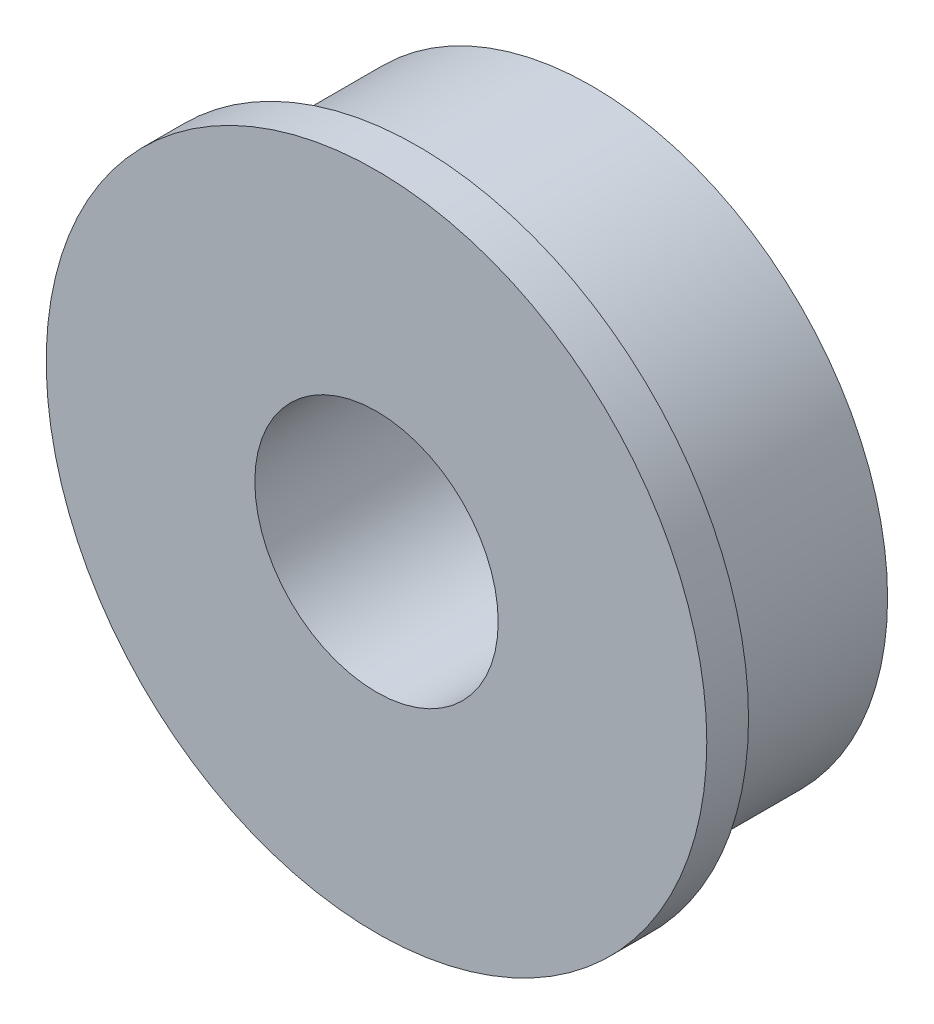
ISO-10303-21;
HEADER;
FILE_DESCRIPTION(('STEP AP214'),'2;1');
FILE_NAME('part.step','',(''),(''),'','','');
FILE_SCHEMA(('AUTOMOTIVE_DESIGN { 1 0 10303 214 1 1 1 1 }'));
ENDSEC;
DATA;
#1=APPLICATION_CONTEXT('core data for automotive mechanical design processes');
#2=APPLICATION_PROTOCOL_DEFINITION('international standard','automotive_design',2000,#1);
#3=PRODUCT_CONTEXT('',#1,'mechanical');
#4=PRODUCT('Part','Part','',(#3));
#5=PRODUCT_RELATED_PRODUCT_CATEGORY('part','',(#4));
#6=PRODUCT_DEFINITION_FORMATION('','',#4);
#7=PRODUCT_DEFINITION_CONTEXT('part definition',#1,'design');
#8=PRODUCT_DEFINITION('design','',#6,#7);
#9=PRODUCT_DEFINITION_SHAPE('','',#8);
#10=(LENGTH_UNIT() NAMED_UNIT(*) SI_UNIT(.MILLI.,.METRE.));
#11=(NAMED_UNIT(*) PLANE_ANGLE_UNIT() SI_UNIT($,.RADIAN.));
#12=(NAMED_UNIT(*) SI_UNIT($,.STERADIAN.) SOLID_ANGLE_UNIT());
#13=UNCERTAINTY_MEASURE_WITH_UNIT(LENGTH_MEASURE(1.E-05),#10,'distance_accuracy_value','');
#14=(GEOMETRIC_REPRESENTATION_CONTEXT(3) GLOBAL_UNCERTAINTY_ASSIGNED_CONTEXT((#13)) GLOBAL_UNIT_ASSIGNED_CONTEXT((#10,
#11,#12)) REPRESENTATION_CONTEXT('',''));
#15=CARTESIAN_POINT('',(0.,0.,0.));
#16=DIRECTION('',(0.,0.,1.));
#17=DIRECTION('',(1.,0.,0.));
#18=AXIS2_PLACEMENT_3D('',#15,#16,#17);
#19=CARTESIAN_POINT('',(0.,0.,5.));
#20=DIRECTION('',(0.,0.,-1.));
#21=DIRECTION('',(-1.,0.,0.));
#22=AXIS2_PLACEMENT_3D('',#19,#20,#21);
#23=CYLINDRICAL_SURFACE('',#22,8.5);
#24=CARTESIAN_POINT('',(0.,0.,5.));
#25=DIRECTION('',(0.,0.,1.));
#26=DIRECTION('',(1.,0.,0.));
#27=AXIS2_PLACEMENT_3D('',#24,#25,#26);
#28=CIRCLE('',#27,8.5);
#29=CARTESIAN_POINT('',(8.5,0.,5.));
#30=VERTEX_POINT('',#29);
#31=EDGE_CURVE('E10',#30,#30,#28,.T.);
#32=ORIENTED_EDGE('',*,*,#31,.F.);
#33=EDGE_LOOP('',(#32));
#34=FACE_BOUND('',#33,.T.);
#35=CARTESIAN_POINT('',(0.,0.,0.));
#36=DIRECTION('',(0.,0.,1.));
#37=DIRECTION('',(1.,0.,0.));
#38=AXIS2_PLACEMENT_3D('',#35,#36,#37);
#39=CIRCLE('',#38,8.5);
#40=CARTESIAN_POINT('',(8.5,0.,0.));
#41=VERTEX_POINT('',#40);
#42=EDGE_CURVE('E34',#41,#41,#39,.T.);
#43=ORIENTED_EDGE('',*,*,#42,.T.);
#44=EDGE_LOOP('',(#43));
#45=FACE_BOUND('',#44,.T.);
#46=ADVANCED_FACE('F31',(#34,#45),#23,.T.);
#47=CARTESIAN_POINT('',(0.,0.,0.));
#48=DIRECTION('',(0.,0.,1.));
#49=DIRECTION('',(1.,0.,0.));
#50=AXIS2_PLACEMENT_3D('',#47,#48,#49);
#51=PLANE('',#50);
#52=CARTESIAN_POINT('',(0.,0.,0.));
#53=DIRECTION('',(0.,0.,1.));
#54=DIRECTION('',(1.,0.,0.));
#55=AXIS2_PLACEMENT_3D('',#52,#53,#54);
#56=CIRCLE('',#55,3.5);
#57=CARTESIAN_POINT('',(3.5,0.,0.));
#58=VERTEX_POINT('',#57);
#59=EDGE_CURVE('E46',#58,#58,#56,.F.);
#60=ORIENTED_EDGE('',*,*,#59,.F.);
#61=EDGE_LOOP('',(#60));
#62=FACE_BOUND('',#61,.T.);
#63=ORIENTED_EDGE('',*,*,#42,.F.);
#64=EDGE_LOOP('',(#63));
#65=FACE_BOUND('',#64,.T.);
#66=ADVANCED_FACE('F68',(#62,#65),#51,.F.);
#67=CARTESIAN_POINT('',(0.,0.,6.2));
#68=DIRECTION('',(0.,0.,-1.));
#69=DIRECTION('',(-1.,0.,0.));
#70=AXIS2_PLACEMENT_3D('',#67,#68,#69);
#71=CYLINDRICAL_SURFACE('',#70,9.5);
#72=CARTESIAN_POINT('',(0.,0.,6.2));
#73=DIRECTION('',(0.,0.,1.));
#74=DIRECTION('',(1.,0.,0.));
#75=AXIS2_PLACEMENT_3D('',#72,#73,#74);
#76=CIRCLE('',#75,9.5);
#77=CARTESIAN_POINT('',(9.5,0.,6.2));
#78=VERTEX_POINT('',#77);
#79=EDGE_CURVE('E41',#78,#78,#76,.T.);
#80=ORIENTED_EDGE('',*,*,#79,.F.);
#81=EDGE_LOOP('',(#80));
#82=FACE_BOUND('',#81,.T.);
#83=CARTESIAN_POINT('',(0.,0.,5.));
#84=DIRECTION('',(0.,0.,1.));
#85=DIRECTION('',(1.,0.,0.));
#86=AXIS2_PLACEMENT_3D('',#83,#84,#85);
#87=CIRCLE('',#86,9.5);
#88=CARTESIAN_POINT('',(9.5,0.,5.));
#89=VERTEX_POINT('',#88);
#90=EDGE_CURVE('E43',#89,#89,#87,.T.);
#91=ORIENTED_EDGE('',*,*,#90,.T.);
#92=EDGE_LOOP('',(#91));
#93=FACE_BOUND('',#92,.T.);
#94=ADVANCED_FACE('F62',(#82,#93),#71,.T.);
#95=CARTESIAN_POINT('',(0.,0.,6.2));
#96=DIRECTION('',(0.,0.,1.));
#97=DIRECTION('',(1.,0.,0.));
#98=AXIS2_PLACEMENT_3D('',#95,#96,#97);
#99=PLANE('',#98);
#100=CARTESIAN_POINT('',(0.,0.,6.2));
#101=DIRECTION('',(0.,0.,1.));
#102=DIRECTION('',(1.,0.,0.));
#103=AXIS2_PLACEMENT_3D('',#100,#101,#102);
#104=CIRCLE('',#103,3.5);
#105=CARTESIAN_POINT('',(3.5,0.,6.2));
#106=VERTEX_POINT('',#105);
#107=EDGE_CURVE('E51',#106,#106,#104,.T.);
#108=ORIENTED_EDGE('',*,*,#107,.F.);
#109=EDGE_LOOP('',(#108));
#110=FACE_BOUND('',#109,.T.);
#111=ORIENTED_EDGE('',*,*,#79,.T.);
#112=EDGE_LOOP('',(#111));
#113=FACE_BOUND('',#112,.T.);
#114=ADVANCED_FACE('F58',(#110,#113),#99,.T.);
#115=CARTESIAN_POINT('',(0.,0.,5.));
#116=DIRECTION('',(0.,0.,1.));
#117=DIRECTION('',(1.,0.,0.));
#118=AXIS2_PLACEMENT_3D('',#115,#116,#117);
#119=PLANE('',#118);
#120=ORIENTED_EDGE('',*,*,#31,.T.);
#121=EDGE_LOOP('',(#120));
#122=FACE_BOUND('',#121,.T.);
#123=ORIENTED_EDGE('',*,*,#90,.F.);
#124=EDGE_LOOP('',(#123));
#125=FACE_BOUND('',#124,.T.);
#126=ADVANCED_FACE('F61',(#122,#125),#119,.F.);
#127=CARTESIAN_POINT('',(0.,0.,-0.00100000000000013));
#128=DIRECTION('',(0.,0.,1.));
#129=DIRECTION('',(1.,0.,0.));
#130=AXIS2_PLACEMENT_3D('',#127,#128,#129);
#131=CYLINDRICAL_SURFACE('',#130,3.5);
#132=ORIENTED_EDGE('',*,*,#107,.T.);
#133=EDGE_LOOP('',(#132));
#134=FACE_BOUND('',#133,.T.);
#135=ORIENTED_EDGE('',*,*,#59,.T.);
#136=EDGE_LOOP('',(#135));
#137=FACE_BOUND('',#136,.T.);
#138=ADVANCED_FACE('F55',(#134,#137),#131,.F.);
#139=CLOSED_SHELL('',(#46,#66,#94,#114,#126,#138));
#140=MANIFOLD_SOLID_BREP('B2',#139);
#141=ADVANCED_BREP_SHAPE_REPRESENTATION('',(#18,#140),#14);
#142=SHAPE_DEFINITION_REPRESENTATION(#9,#141);
ENDSEC;
END-ISO-10303-21;
